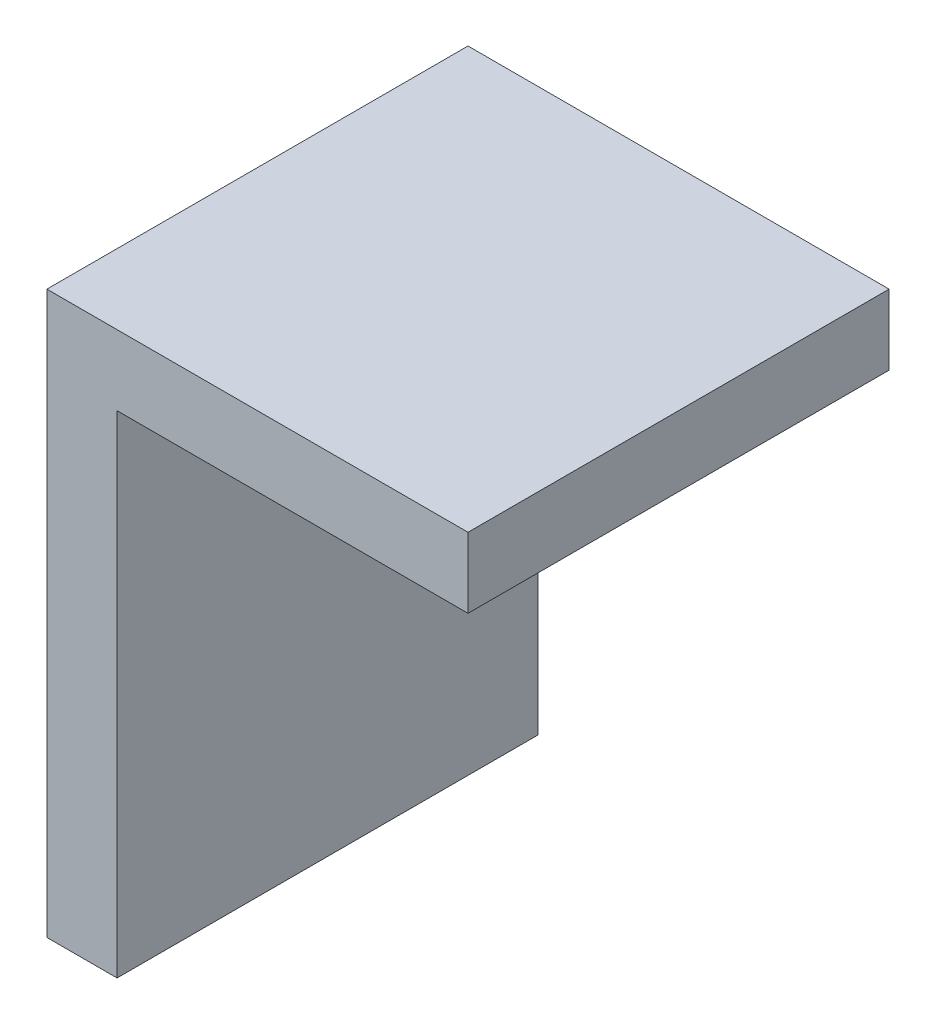
ISO-10303-21;
HEADER;
FILE_DESCRIPTION(('STEP AP214'),'2;1');
FILE_NAME('part.step','',(''),(''),'','','');
FILE_SCHEMA(('AUTOMOTIVE_DESIGN { 1 0 10303 214 1 1 1 1 }'));
ENDSEC;
DATA;
#1=APPLICATION_CONTEXT('core data for automotive mechanical design processes');
#2=APPLICATION_PROTOCOL_DEFINITION('international standard','automotive_design',2000,#1);
#3=PRODUCT_CONTEXT('',#1,'mechanical');
#4=PRODUCT('Part','Part','',(#3));
#5=PRODUCT_RELATED_PRODUCT_CATEGORY('part','',(#4));
#6=PRODUCT_DEFINITION_FORMATION('','',#4);
#7=PRODUCT_DEFINITION_CONTEXT('part definition',#1,'design');
#8=PRODUCT_DEFINITION('design','',#6,#7);
#9=PRODUCT_DEFINITION_SHAPE('','',#8);
#10=(LENGTH_UNIT() NAMED_UNIT(*) SI_UNIT(.MILLI.,.METRE.));
#11=(NAMED_UNIT(*) PLANE_ANGLE_UNIT() SI_UNIT($,.RADIAN.));
#12=(NAMED_UNIT(*) SI_UNIT($,.STERADIAN.) SOLID_ANGLE_UNIT());
#13=UNCERTAINTY_MEASURE_WITH_UNIT(LENGTH_MEASURE(1.E-05),#10,'distance_accuracy_value','');
#14=(GEOMETRIC_REPRESENTATION_CONTEXT(3) GLOBAL_UNCERTAINTY_ASSIGNED_CONTEXT((#13)) GLOBAL_UNIT_ASSIGNED_CONTEXT((#10,
#11,#12)) REPRESENTATION_CONTEXT('',''));
#15=CARTESIAN_POINT('',(0.,0.,0.));
#16=DIRECTION('',(0.,0.,1.));
#17=DIRECTION('',(1.,0.,0.));
#18=AXIS2_PLACEMENT_3D('',#15,#16,#17);
#19=CARTESIAN_POINT('',(-17.0192307692308,0.,30.));
#20=DIRECTION('',(1.,0.,0.));
#21=DIRECTION('',(0.,1.,0.));
#22=AXIS2_PLACEMENT_3D('',#19,#20,#21);
#23=PLANE('',#22);
#24=DIRECTION('',(0.,-1.,0.));
#25=VECTOR('',#24,1.);
#26=CARTESIAN_POINT('',(-17.0192307692308,0.,0.));
#27=LINE('',#26,#25);
#28=CARTESIAN_POINT('',(-17.0192307692308,15.9182578042946,0.));
#29=VERTEX_POINT('',#28);
#30=CARTESIAN_POINT('',(-17.0192307692308,-19.0817421957054,0.));
#31=VERTEX_POINT('',#30);
#32=EDGE_CURVE('E130',#29,#31,#27,.T.);
#33=ORIENTED_EDGE('',*,*,#32,.F.);
#34=DIRECTION('',(0.,0.,-1.));
#35=VECTOR('',#34,1.);
#36=CARTESIAN_POINT('',(-17.0192307692308,15.9182578042946,30.));
#37=LINE('',#36,#35);
#38=CARTESIAN_POINT('',(-17.0192307692308,15.9182578042946,30.));
#39=VERTEX_POINT('',#38);
#40=EDGE_CURVE('E12',#39,#29,#37,.T.);
#41=ORIENTED_EDGE('',*,*,#40,.F.);
#42=DIRECTION('',(0.,-1.,0.));
#43=VECTOR('',#42,1.);
#44=CARTESIAN_POINT('',(-17.0192307692308,0.,30.));
#45=LINE('',#44,#43);
#46=CARTESIAN_POINT('',(-17.0192307692308,-19.0817421957054,30.));
#47=VERTEX_POINT('',#46);
#48=EDGE_CURVE('E158',#39,#47,#45,.T.);
#49=ORIENTED_EDGE('',*,*,#48,.T.);
#50=DIRECTION('',(0.,0.,-1.));
#51=VECTOR('',#50,1.);
#52=CARTESIAN_POINT('',(-17.0192307692308,-19.0817421957054,30.));
#53=LINE('',#52,#51);
#54=EDGE_CURVE('E153',#47,#31,#53,.T.);
#55=ORIENTED_EDGE('',*,*,#54,.T.);
#56=EDGE_LOOP('',(#33,#41,#49,#55));
#57=FACE_BOUND('',#56,.T.);
#58=ADVANCED_FACE('F56',(#57),#23,.T.);
#59=CARTESIAN_POINT('',(-22.0192307692308,0.,30.));
#60=DIRECTION('',(1.,0.,0.));
#61=DIRECTION('',(0.,0.,-1.));
#62=AXIS2_PLACEMENT_3D('',#59,#60,#61);
#63=PLANE('',#62);
#64=DIRECTION('',(0.,-1.,0.));
#65=VECTOR('',#64,1.);
#66=CARTESIAN_POINT('',(-22.0192307692308,0.,0.));
#67=LINE('',#66,#65);
#68=CARTESIAN_POINT('',(-22.0192307692308,20.9182578042946,0.));
#69=VERTEX_POINT('',#68);
#70=CARTESIAN_POINT('',(-22.0192307692308,-19.0817421957054,0.));
#71=VERTEX_POINT('',#70);
#72=EDGE_CURVE('E159',#69,#71,#67,.T.);
#73=ORIENTED_EDGE('',*,*,#72,.T.);
#74=DIRECTION('',(0.,0.,-1.));
#75=VECTOR('',#74,1.);
#76=CARTESIAN_POINT('',(-22.0192307692308,-19.0817421957054,30.));
#77=LINE('',#76,#75);
#78=CARTESIAN_POINT('',(-22.0192307692308,-19.0817421957054,30.));
#79=VERTEX_POINT('',#78);
#80=EDGE_CURVE('E66',#79,#71,#77,.T.);
#81=ORIENTED_EDGE('',*,*,#80,.F.);
#82=DIRECTION('',(0.,-1.,0.));
#83=VECTOR('',#82,1.);
#84=CARTESIAN_POINT('',(-22.0192307692308,0.,30.));
#85=LINE('',#84,#83);
#86=CARTESIAN_POINT('',(-22.0192307692308,20.9182578042946,30.));
#87=VERTEX_POINT('',#86);
#88=EDGE_CURVE('E162',#87,#79,#85,.T.);
#89=ORIENTED_EDGE('',*,*,#88,.F.);
#90=DIRECTION('',(0.,0.,-1.));
#91=VECTOR('',#90,1.);
#92=CARTESIAN_POINT('',(-22.0192307692308,20.9182578042946,30.));
#93=LINE('',#92,#91);
#94=EDGE_CURVE('E142',#87,#69,#93,.T.);
#95=ORIENTED_EDGE('',*,*,#94,.T.);
#96=EDGE_LOOP('',(#73,#81,#89,#95));
#97=FACE_BOUND('',#96,.T.);
#98=ADVANCED_FACE('F173',(#97),#63,.F.);
#99=CARTESIAN_POINT('',(0.,-19.0817421957054,30.));
#100=DIRECTION('',(0.,1.,0.));
#101=DIRECTION('',(0.,0.,1.));
#102=AXIS2_PLACEMENT_3D('',#99,#100,#101);
#103=PLANE('',#102);
#104=DIRECTION('',(1.,0.,0.));
#105=VECTOR('',#104,1.);
#106=CARTESIAN_POINT('',(0.,-19.0817421957054,0.));
#107=LINE('',#106,#105);
#108=EDGE_CURVE('E155',#71,#31,#107,.T.);
#109=ORIENTED_EDGE('',*,*,#108,.T.);
#110=ORIENTED_EDGE('',*,*,#54,.F.);
#111=DIRECTION('',(1.,0.,0.));
#112=VECTOR('',#111,1.);
#113=CARTESIAN_POINT('',(0.,-19.0817421957054,30.));
#114=LINE('',#113,#112);
#115=EDGE_CURVE('E75',#79,#47,#114,.T.);
#116=ORIENTED_EDGE('',*,*,#115,.F.);
#117=ORIENTED_EDGE('',*,*,#80,.T.);
#118=EDGE_LOOP('',(#109,#110,#116,#117));
#119=FACE_BOUND('',#118,.T.);
#120=ADVANCED_FACE('F171',(#119),#103,.F.);
#121=CARTESIAN_POINT('',(0.,0.,30.));
#122=DIRECTION('',(0.,0.,1.));
#123=DIRECTION('',(1.,0.,0.));
#124=AXIS2_PLACEMENT_3D('',#121,#122,#123);
#125=PLANE('',#124);
#126=ORIENTED_EDGE('',*,*,#48,.F.);
#127=DIRECTION('',(1.,0.,0.));
#128=VECTOR('',#127,1.);
#129=CARTESIAN_POINT('',(-22.0192307692308,15.9182578042946,30.));
#130=LINE('',#129,#128);
#131=CARTESIAN_POINT('',(7.98076923076923,15.9182578042946,30.));
#132=VERTEX_POINT('',#131);
#133=EDGE_CURVE('E143',#39,#132,#130,.T.);
#134=ORIENTED_EDGE('',*,*,#133,.T.);
#135=DIRECTION('',(0.,1.,0.));
#136=VECTOR('',#135,1.);
#137=CARTESIAN_POINT('',(7.98076923076923,15.9182578042946,30.));
#138=LINE('',#137,#136);
#139=CARTESIAN_POINT('',(7.98076923076923,20.9182578042946,30.));
#140=VERTEX_POINT('',#139);
#141=EDGE_CURVE('E129',#132,#140,#138,.T.);
#142=ORIENTED_EDGE('',*,*,#141,.T.);
#143=DIRECTION('',(1.,0.,0.));
#144=VECTOR('',#143,1.);
#145=CARTESIAN_POINT('',(-22.0192307692308,20.9182578042946,30.));
#146=LINE('',#145,#144);
#147=EDGE_CURVE('E123',#87,#140,#146,.T.);
#148=ORIENTED_EDGE('',*,*,#147,.F.);
#149=ORIENTED_EDGE('',*,*,#88,.T.);
#150=ORIENTED_EDGE('',*,*,#115,.T.);
#151=EDGE_LOOP('',(#126,#134,#142,#148,#149,#150));
#152=FACE_BOUND('',#151,.T.);
#153=ADVANCED_FACE('F181',(#152),#125,.T.);
#154=CARTESIAN_POINT('',(0.,0.,0.));
#155=DIRECTION('',(0.,0.,1.));
#156=DIRECTION('',(1.,0.,0.));
#157=AXIS2_PLACEMENT_3D('',#154,#155,#156);
#158=PLANE('',#157);
#159=ORIENTED_EDGE('',*,*,#32,.T.);
#160=ORIENTED_EDGE('',*,*,#108,.F.);
#161=ORIENTED_EDGE('',*,*,#72,.F.);
#162=DIRECTION('',(1.,0.,0.));
#163=VECTOR('',#162,1.);
#164=CARTESIAN_POINT('',(-22.0192307692308,20.9182578042946,0.));
#165=LINE('',#164,#163);
#166=CARTESIAN_POINT('',(7.98076923076923,20.9182578042946,0.));
#167=VERTEX_POINT('',#166);
#168=EDGE_CURVE('E133',#69,#167,#165,.T.);
#169=ORIENTED_EDGE('',*,*,#168,.T.);
#170=DIRECTION('',(0.,1.,0.));
#171=VECTOR('',#170,1.);
#172=CARTESIAN_POINT('',(7.98076923076923,15.9182578042946,0.));
#173=LINE('',#172,#171);
#174=CARTESIAN_POINT('',(7.98076923076923,15.9182578042946,0.));
#175=VERTEX_POINT('',#174);
#176=EDGE_CURVE('E124',#175,#167,#173,.T.);
#177=ORIENTED_EDGE('',*,*,#176,.F.);
#178=DIRECTION('',(1.,0.,0.));
#179=VECTOR('',#178,1.);
#180=CARTESIAN_POINT('',(-22.0192307692308,15.9182578042946,0.));
#181=LINE('',#180,#179);
#182=EDGE_CURVE('E112',#29,#175,#181,.T.);
#183=ORIENTED_EDGE('',*,*,#182,.F.);
#184=EDGE_LOOP('',(#159,#160,#161,#169,#177,#183));
#185=FACE_BOUND('',#184,.T.);
#186=ADVANCED_FACE('F132',(#185),#158,.F.);
#187=CARTESIAN_POINT('',(-22.0192307692308,20.9182578042946,30.));
#188=DIRECTION('',(0.,1.,0.));
#189=DIRECTION('',(0.,0.,1.));
#190=AXIS2_PLACEMENT_3D('',#187,#188,#189);
#191=PLANE('',#190);
#192=ORIENTED_EDGE('',*,*,#168,.F.);
#193=ORIENTED_EDGE('',*,*,#94,.F.);
#194=ORIENTED_EDGE('',*,*,#147,.T.);
#195=DIRECTION('',(0.,0.,-1.));
#196=VECTOR('',#195,1.);
#197=CARTESIAN_POINT('',(7.98076923076923,20.9182578042946,30.));
#198=LINE('',#197,#196);
#199=EDGE_CURVE('E106',#140,#167,#198,.T.);
#200=ORIENTED_EDGE('',*,*,#199,.T.);
#201=EDGE_LOOP('',(#192,#193,#194,#200));
#202=FACE_BOUND('',#201,.T.);
#203=ADVANCED_FACE('F58',(#202),#191,.T.);
#204=CARTESIAN_POINT('',(7.98076923076923,15.9182578042946,30.));
#205=DIRECTION('',(-1.,0.,0.));
#206=DIRECTION('',(0.,0.,1.));
#207=AXIS2_PLACEMENT_3D('',#204,#205,#206);
#208=PLANE('',#207);
#209=ORIENTED_EDGE('',*,*,#176,.T.);
#210=ORIENTED_EDGE('',*,*,#199,.F.);
#211=ORIENTED_EDGE('',*,*,#141,.F.);
#212=DIRECTION('',(0.,0.,-1.));
#213=VECTOR('',#212,1.);
#214=CARTESIAN_POINT('',(7.98076923076923,15.9182578042946,30.));
#215=LINE('',#214,#213);
#216=EDGE_CURVE('E116',#132,#175,#215,.T.);
#217=ORIENTED_EDGE('',*,*,#216,.T.);
#218=EDGE_LOOP('',(#209,#210,#211,#217));
#219=FACE_BOUND('',#218,.T.);
#220=ADVANCED_FACE('F127',(#219),#208,.F.);
#221=CARTESIAN_POINT('',(-22.0192307692308,15.9182578042946,30.));
#222=DIRECTION('',(0.,1.,0.));
#223=DIRECTION('',(0.,0.,1.));
#224=AXIS2_PLACEMENT_3D('',#221,#222,#223);
#225=PLANE('',#224);
#226=ORIENTED_EDGE('',*,*,#133,.F.);
#227=ORIENTED_EDGE('',*,*,#40,.T.);
#228=ORIENTED_EDGE('',*,*,#182,.T.);
#229=ORIENTED_EDGE('',*,*,#216,.F.);
#230=EDGE_LOOP('',(#226,#227,#228,#229));
#231=FACE_BOUND('',#230,.T.);
#232=ADVANCED_FACE('F115',(#231),#225,.F.);
#233=CLOSED_SHELL('',(#58,#98,#120,#153,#186,#203,#220,#232));
#234=MANIFOLD_SOLID_BREP('B2',#233);
#235=ADVANCED_BREP_SHAPE_REPRESENTATION('',(#18,#234),#14);
#236=SHAPE_DEFINITION_REPRESENTATION(#9,#235);
ENDSEC;
END-ISO-10303-21;
